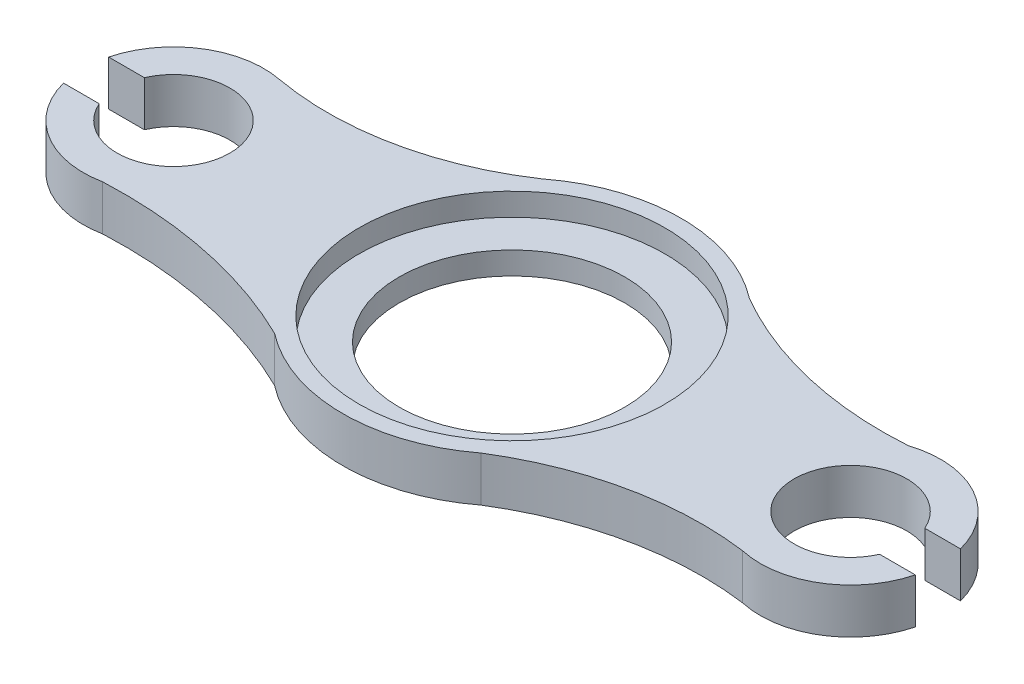
ISO-10303-21;
HEADER;
FILE_DESCRIPTION(('STEP AP214'),'2;1');
FILE_NAME('part.step','',(''),(''),'','','');
FILE_SCHEMA(('AUTOMOTIVE_DESIGN { 1 0 10303 214 1 1 1 1 }'));
ENDSEC;
DATA;
#1=APPLICATION_CONTEXT('core data for automotive mechanical design processes');
#2=APPLICATION_PROTOCOL_DEFINITION('international standard','automotive_design',2000,#1);
#3=PRODUCT_CONTEXT('',#1,'mechanical');
#4=PRODUCT('Part','Part','',(#3));
#5=PRODUCT_RELATED_PRODUCT_CATEGORY('part','',(#4));
#6=PRODUCT_DEFINITION_FORMATION('','',#4);
#7=PRODUCT_DEFINITION_CONTEXT('part definition',#1,'design');
#8=PRODUCT_DEFINITION('design','',#6,#7);
#9=PRODUCT_DEFINITION_SHAPE('','',#8);
#10=(LENGTH_UNIT() NAMED_UNIT(*) SI_UNIT(.MILLI.,.METRE.));
#11=(NAMED_UNIT(*) PLANE_ANGLE_UNIT() SI_UNIT($,.RADIAN.));
#12=(NAMED_UNIT(*) SI_UNIT($,.STERADIAN.) SOLID_ANGLE_UNIT());
#13=UNCERTAINTY_MEASURE_WITH_UNIT(LENGTH_MEASURE(1.E-05),#10,'distance_accuracy_value','');
#14=(GEOMETRIC_REPRESENTATION_CONTEXT(3) GLOBAL_UNCERTAINTY_ASSIGNED_CONTEXT((#13)) GLOBAL_UNIT_ASSIGNED_CONTEXT((#10,
#11,#12)) REPRESENTATION_CONTEXT('',''));
#15=CARTESIAN_POINT('',(0.,0.,0.));
#16=DIRECTION('',(0.,0.,1.));
#17=DIRECTION('',(1.,0.,0.));
#18=AXIS2_PLACEMENT_3D('',#15,#16,#17);
#19=CARTESIAN_POINT('',(0.,20.,0.));
#20=DIRECTION('',(0.,1.,0.));
#21=DIRECTION('',(0.,0.,1.));
#22=AXIS2_PLACEMENT_3D('',#19,#20,#21);
#23=PLANE('',#22);
#24=CARTESIAN_POINT('',(0.,20.,0.));
#25=DIRECTION('',(0.,1.,0.));
#26=DIRECTION('',(0.,0.,1.));
#27=AXIS2_PLACEMENT_3D('',#24,#25,#26);
#28=CIRCLE('',#27,67.75);
#29=CARTESIAN_POINT('',(0.,20.,67.75));
#30=VERTEX_POINT('',#29);
#31=EDGE_CURVE('E306',#30,#30,#28,.T.);
#32=ORIENTED_EDGE('',*,*,#31,.F.);
#33=EDGE_LOOP('',(#32));
#34=FACE_BOUND('',#33,.T.);
#35=CARTESIAN_POINT('',(121.910756914697,20.,182.089420540759));
#36=DIRECTION('',(0.,1.,0.));
#37=DIRECTION('',(0.,0.,1.));
#38=AXIS2_PLACEMENT_3D('',#35,#36,#37);
#39=CIRCLE('',#38,144.370857917916);
#40=CARTESIAN_POINT('',(141.123685995529,20.,39.0027056714536));
#41=VERTEX_POINT('',#40);
#42=CARTESIAN_POINT('',(45.6718820439933,20.,59.4901604516206));
#43=VERTEX_POINT('',#42);
#44=EDGE_CURVE('E261',#41,#43,#39,.T.);
#45=ORIENTED_EDGE('',*,*,#44,.F.);
#46=CARTESIAN_POINT('',(150.,20.,0.));
#47=DIRECTION('',(0.,1.,0.));
#48=DIRECTION('',(0.,0.,1.));
#49=AXIS2_PLACEMENT_3D('',#46,#47,#48);
#50=CIRCLE('',#49,40.);
#51=CARTESIAN_POINT('',(188.729833462074,20.,10.));
#52=VERTEX_POINT('',#51);
#53=EDGE_CURVE('E243',#41,#52,#50,.T.);
#54=ORIENTED_EDGE('',*,*,#53,.T.);
#55=DIRECTION('',(1.,0.,0.));
#56=VECTOR('',#55,1.);
#57=CARTESIAN_POINT('',(0.,20.,9.99999999999999));
#58=LINE('',#57,#56);
#59=CARTESIAN_POINT('',(172.912878474779,20.,10.));
#60=VERTEX_POINT('',#59);
#61=EDGE_CURVE('E360',#60,#52,#58,.T.);
#62=ORIENTED_EDGE('',*,*,#61,.F.);
#63=CARTESIAN_POINT('',(150.,20.,0.));
#64=DIRECTION('',(0.,-1.,0.));
#65=DIRECTION('',(0.,0.,-1.));
#66=AXIS2_PLACEMENT_3D('',#63,#64,#65);
#67=CIRCLE('',#66,25.);
#68=CARTESIAN_POINT('',(172.912878474779,20.,-9.99999999999998));
#69=VERTEX_POINT('',#68);
#70=EDGE_CURVE('E354',#60,#69,#67,.T.);
#71=ORIENTED_EDGE('',*,*,#70,.T.);
#72=DIRECTION('',(1.,0.,0.));
#73=VECTOR('',#72,1.);
#74=CARTESIAN_POINT('',(0.,20.,-10.));
#75=LINE('',#74,#73);
#76=CARTESIAN_POINT('',(188.729833462074,20.,-9.99999999999998));
#77=VERTEX_POINT('',#76);
#78=EDGE_CURVE('E357',#69,#77,#75,.T.);
#79=ORIENTED_EDGE('',*,*,#78,.T.);
#80=CARTESIAN_POINT('',(150.,20.,0.));
#81=DIRECTION('',(0.,1.,0.));
#82=DIRECTION('',(0.,0.,1.));
#83=AXIS2_PLACEMENT_3D('',#80,#81,#82);
#84=CIRCLE('',#83,40.);
#85=CARTESIAN_POINT('',(137.683691630427,20.,-38.0566491975527));
#86=VERTEX_POINT('',#85);
#87=EDGE_CURVE('E274',#77,#86,#84,.T.);
#88=ORIENTED_EDGE('',*,*,#87,.T.);
#89=CARTESIAN_POINT('',(126.34717209194,20.,-197.995020701724));
#90=DIRECTION('',(0.,1.,0.));
#91=DIRECTION('',(0.,0.,1.));
#92=AXIS2_PLACEMENT_3D('',#89,#90,#91);
#93=CIRCLE('',#92,160.339637503185);
#94=CARTESIAN_POINT('',(45.9870488390436,20.,-59.2468677575062));
#95=VERTEX_POINT('',#94);
#96=EDGE_CURVE('E268',#95,#86,#93,.T.);
#97=ORIENTED_EDGE('',*,*,#96,.F.);
#98=CARTESIAN_POINT('',(0.,20.,0.));
#99=DIRECTION('',(0.,1.,0.));
#100=DIRECTION('',(0.,0.,1.));
#101=AXIS2_PLACEMENT_3D('',#98,#99,#100);
#102=CIRCLE('',#101,75.);
#103=CARTESIAN_POINT('',(-45.9870488390434,20.,-59.2468677575063));
#104=VERTEX_POINT('',#103);
#105=EDGE_CURVE('E319',#95,#104,#102,.T.);
#106=ORIENTED_EDGE('',*,*,#105,.T.);
#107=CARTESIAN_POINT('',(-118.810735047892,20.,-168.056888799454));
#108=DIRECTION('',(0.,1.,0.));
#109=DIRECTION('',(0.,0.,1.));
#110=AXIS2_PLACEMENT_3D('',#107,#108,#109);
#111=CIRCLE('',#110,130.930935810426);
#112=CARTESIAN_POINT('',(-142.192482618015,20.,-39.2306343605351));
#113=VERTEX_POINT('',#112);
#114=EDGE_CURVE('E284',#104,#113,#111,.F.);
#115=ORIENTED_EDGE('',*,*,#114,.T.);
#116=CARTESIAN_POINT('',(-150.,20.,0.));
#117=DIRECTION('',(0.,1.,0.));
#118=DIRECTION('',(0.,0.,1.));
#119=AXIS2_PLACEMENT_3D('',#116,#117,#118);
#120=CIRCLE('',#119,40.);
#121=CARTESIAN_POINT('',(-188.729833462074,20.,-10.));
#122=VERTEX_POINT('',#121);
#123=EDGE_CURVE('E313',#113,#122,#120,.T.);
#124=ORIENTED_EDGE('',*,*,#123,.T.);
#125=DIRECTION('',(1.,0.,0.));
#126=VECTOR('',#125,1.);
#127=CARTESIAN_POINT('',(0.,20.,-9.99999999999998));
#128=LINE('',#127,#126);
#129=CARTESIAN_POINT('',(-172.912878474779,20.,-10.));
#130=VERTEX_POINT('',#129);
#131=EDGE_CURVE('E334',#122,#130,#128,.T.);
#132=ORIENTED_EDGE('',*,*,#131,.T.);
#133=CARTESIAN_POINT('',(-150.,20.,0.));
#134=DIRECTION('',(0.,-1.,0.));
#135=DIRECTION('',(0.,0.,-1.));
#136=AXIS2_PLACEMENT_3D('',#133,#134,#135);
#137=CIRCLE('',#136,25.);
#138=CARTESIAN_POINT('',(-172.912878474779,20.,9.99999999999999));
#139=VERTEX_POINT('',#138);
#140=EDGE_CURVE('E336',#130,#139,#137,.T.);
#141=ORIENTED_EDGE('',*,*,#140,.T.);
#142=DIRECTION('',(1.,0.,0.));
#143=VECTOR('',#142,1.);
#144=CARTESIAN_POINT('',(0.,20.,10.));
#145=LINE('',#144,#143);
#146=CARTESIAN_POINT('',(-188.729833462074,20.,9.99999999999999));
#147=VERTEX_POINT('',#146);
#148=EDGE_CURVE('E340',#147,#139,#145,.T.);
#149=ORIENTED_EDGE('',*,*,#148,.F.);
#150=CARTESIAN_POINT('',(-150.,20.,0.));
#151=DIRECTION('',(0.,1.,0.));
#152=DIRECTION('',(0.,0.,1.));
#153=AXIS2_PLACEMENT_3D('',#150,#151,#152);
#154=CIRCLE('',#153,40.);
#155=CARTESIAN_POINT('',(-142.192482618014,20.,39.2306343605349));
#156=VERTEX_POINT('',#155);
#157=EDGE_CURVE('E146',#147,#156,#154,.T.);
#158=ORIENTED_EDGE('',*,*,#157,.T.);
#159=CARTESIAN_POINT('',(-133.055354615705,20.,236.521808115654));
#160=DIRECTION('',(0.,1.,0.));
#161=DIRECTION('',(0.,0.,1.));
#162=AXIS2_PLACEMENT_3D('',#159,#160,#161);
#163=CIRCLE('',#162,197.502643905856);
#164=CARTESIAN_POINT('',(-45.9870488390436,20.,59.2468677575061));
#165=VERTEX_POINT('',#164);
#166=EDGE_CURVE('E297',#156,#165,#163,.F.);
#167=ORIENTED_EDGE('',*,*,#166,.T.);
#168=CARTESIAN_POINT('',(0.,20.,0.));
#169=DIRECTION('',(0.,1.,0.));
#170=DIRECTION('',(0.,0.,1.));
#171=AXIS2_PLACEMENT_3D('',#168,#169,#170);
#172=CIRCLE('',#171,75.);
#173=EDGE_CURVE('E292',#165,#43,#172,.T.);
#174=ORIENTED_EDGE('',*,*,#173,.T.);
#175=EDGE_LOOP('',(#45,#54,#62,#71,#79,#88,#97,#106,#115,#124,#132,#141,#149,#158,#167,#174));
#176=FACE_BOUND('',#175,.T.);
#177=ADVANCED_FACE('F121',(#34,#176),#23,.T.);
#178=CARTESIAN_POINT('',(0.,0.,0.));
#179=DIRECTION('',(0.,1.,0.));
#180=DIRECTION('',(0.,0.,1.));
#181=AXIS2_PLACEMENT_3D('',#178,#179,#180);
#182=PLANE('',#181);
#183=CARTESIAN_POINT('',(0.,0.,0.));
#184=DIRECTION('',(0.,-1.,0.));
#185=DIRECTION('',(0.,0.,-1.));
#186=AXIS2_PLACEMENT_3D('',#183,#184,#185);
#187=CIRCLE('',#186,50.);
#188=CARTESIAN_POINT('',(0.,0.,-50.));
#189=VERTEX_POINT('',#188);
#190=EDGE_CURVE('E345',#189,#189,#187,.T.);
#191=ORIENTED_EDGE('',*,*,#190,.F.);
#192=EDGE_LOOP('',(#191));
#193=FACE_BOUND('',#192,.T.);
#194=CARTESIAN_POINT('',(150.,0.,0.));
#195=DIRECTION('',(0.,1.,0.));
#196=DIRECTION('',(0.,0.,1.));
#197=AXIS2_PLACEMENT_3D('',#194,#195,#196);
#198=CIRCLE('',#197,40.);
#199=CARTESIAN_POINT('',(141.123685995529,0.,39.0027056714536));
#200=VERTEX_POINT('',#199);
#201=CARTESIAN_POINT('',(188.729833462074,0.,10.));
#202=VERTEX_POINT('',#201);
#203=EDGE_CURVE('E240',#200,#202,#198,.T.);
#204=ORIENTED_EDGE('',*,*,#203,.F.);
#205=CARTESIAN_POINT('',(121.910756914697,0.,182.089420540759));
#206=DIRECTION('',(0.,1.,0.));
#207=DIRECTION('',(0.,0.,1.));
#208=AXIS2_PLACEMENT_3D('',#205,#206,#207);
#209=CIRCLE('',#208,144.370857917916);
#210=CARTESIAN_POINT('',(45.6718820439933,0.,59.4901604516206));
#211=VERTEX_POINT('',#210);
#212=EDGE_CURVE('E248',#200,#211,#209,.T.);
#213=ORIENTED_EDGE('',*,*,#212,.T.);
#214=CARTESIAN_POINT('',(0.,0.,0.));
#215=DIRECTION('',(0.,1.,0.));
#216=DIRECTION('',(0.,0.,1.));
#217=AXIS2_PLACEMENT_3D('',#214,#215,#216);
#218=CIRCLE('',#217,75.);
#219=CARTESIAN_POINT('',(-45.9870488390436,0.,59.2468677575061));
#220=VERTEX_POINT('',#219);
#221=EDGE_CURVE('E294',#220,#211,#218,.T.);
#222=ORIENTED_EDGE('',*,*,#221,.F.);
#223=CARTESIAN_POINT('',(-133.055354615705,0.,236.521808115654));
#224=DIRECTION('',(0.,1.,0.));
#225=DIRECTION('',(0.,0.,1.));
#226=AXIS2_PLACEMENT_3D('',#223,#224,#225);
#227=CIRCLE('',#226,197.502643905856);
#228=CARTESIAN_POINT('',(-142.192482618014,0.,39.2306343605349));
#229=VERTEX_POINT('',#228);
#230=EDGE_CURVE('E289',#229,#220,#227,.F.);
#231=ORIENTED_EDGE('',*,*,#230,.F.);
#232=CARTESIAN_POINT('',(-150.,0.,0.));
#233=DIRECTION('',(0.,1.,0.));
#234=DIRECTION('',(0.,0.,1.));
#235=AXIS2_PLACEMENT_3D('',#232,#233,#234);
#236=CIRCLE('',#235,40.);
#237=CARTESIAN_POINT('',(-188.729833462074,0.,9.99999999999999));
#238=VERTEX_POINT('',#237);
#239=EDGE_CURVE('E291',#238,#229,#236,.T.);
#240=ORIENTED_EDGE('',*,*,#239,.F.);
#241=DIRECTION('',(1.,0.,0.));
#242=VECTOR('',#241,1.);
#243=CARTESIAN_POINT('',(0.,0.,10.));
#244=LINE('',#243,#242);
#245=CARTESIAN_POINT('',(-172.912878474779,0.,9.99999999999999));
#246=VERTEX_POINT('',#245);
#247=EDGE_CURVE('E337',#238,#246,#244,.T.);
#248=ORIENTED_EDGE('',*,*,#247,.T.);
#249=CARTESIAN_POINT('',(-150.,0.,0.));
#250=DIRECTION('',(0.,-1.,0.));
#251=DIRECTION('',(0.,0.,-1.));
#252=AXIS2_PLACEMENT_3D('',#249,#250,#251);
#253=CIRCLE('',#252,25.);
#254=CARTESIAN_POINT('',(-172.912878474779,0.,-10.));
#255=VERTEX_POINT('',#254);
#256=EDGE_CURVE('E344',#255,#246,#253,.T.);
#257=ORIENTED_EDGE('',*,*,#256,.F.);
#258=DIRECTION('',(1.,0.,0.));
#259=VECTOR('',#258,1.);
#260=CARTESIAN_POINT('',(0.,0.,-9.99999999999998));
#261=LINE('',#260,#259);
#262=CARTESIAN_POINT('',(-188.729833462074,0.,-10.));
#263=VERTEX_POINT('',#262);
#264=EDGE_CURVE('E342',#263,#255,#261,.T.);
#265=ORIENTED_EDGE('',*,*,#264,.F.);
#266=CARTESIAN_POINT('',(-150.,0.,0.));
#267=DIRECTION('',(0.,1.,0.));
#268=DIRECTION('',(0.,0.,1.));
#269=AXIS2_PLACEMENT_3D('',#266,#267,#268);
#270=CIRCLE('',#269,40.);
#271=CARTESIAN_POINT('',(-142.192482618015,0.,-39.2306343605351));
#272=VERTEX_POINT('',#271);
#273=EDGE_CURVE('E138',#272,#263,#270,.T.);
#274=ORIENTED_EDGE('',*,*,#273,.F.);
#275=CARTESIAN_POINT('',(-118.810735047892,0.,-168.056888799454));
#276=DIRECTION('',(0.,1.,0.));
#277=DIRECTION('',(0.,0.,1.));
#278=AXIS2_PLACEMENT_3D('',#275,#276,#277);
#279=CIRCLE('',#278,130.930935810426);
#280=CARTESIAN_POINT('',(-45.9870488390434,0.,-59.2468677575063));
#281=VERTEX_POINT('',#280);
#282=EDGE_CURVE('E310',#281,#272,#279,.F.);
#283=ORIENTED_EDGE('',*,*,#282,.F.);
#284=CARTESIAN_POINT('',(0.,0.,0.));
#285=DIRECTION('',(0.,1.,0.));
#286=DIRECTION('',(0.,0.,1.));
#287=AXIS2_PLACEMENT_3D('',#284,#285,#286);
#288=CIRCLE('',#287,75.);
#289=CARTESIAN_POINT('',(45.9870488390436,0.,-59.2468677575062));
#290=VERTEX_POINT('',#289);
#291=EDGE_CURVE('E312',#290,#281,#288,.T.);
#292=ORIENTED_EDGE('',*,*,#291,.F.);
#293=CARTESIAN_POINT('',(126.34717209194,0.,-197.995020701724));
#294=DIRECTION('',(0.,1.,0.));
#295=DIRECTION('',(0.,0.,1.));
#296=AXIS2_PLACEMENT_3D('',#293,#294,#295);
#297=CIRCLE('',#296,160.339637503185);
#298=CARTESIAN_POINT('',(137.683691630427,0.,-38.0566491975527));
#299=VERTEX_POINT('',#298);
#300=EDGE_CURVE('E270',#290,#299,#297,.T.);
#301=ORIENTED_EDGE('',*,*,#300,.T.);
#302=CARTESIAN_POINT('',(150.,0.,0.));
#303=DIRECTION('',(0.,1.,0.));
#304=DIRECTION('',(0.,0.,1.));
#305=AXIS2_PLACEMENT_3D('',#302,#303,#304);
#306=CIRCLE('',#305,40.);
#307=CARTESIAN_POINT('',(188.729833462074,0.,-9.99999999999998));
#308=VERTEX_POINT('',#307);
#309=EDGE_CURVE('E273',#308,#299,#306,.T.);
#310=ORIENTED_EDGE('',*,*,#309,.F.);
#311=DIRECTION('',(1.,0.,0.));
#312=VECTOR('',#311,1.);
#313=CARTESIAN_POINT('',(0.,0.,-10.));
#314=LINE('',#313,#312);
#315=CARTESIAN_POINT('',(172.912878474779,0.,-9.99999999999998));
#316=VERTEX_POINT('',#315);
#317=EDGE_CURVE('E366',#316,#308,#314,.T.);
#318=ORIENTED_EDGE('',*,*,#317,.F.);
#319=CARTESIAN_POINT('',(150.,0.,0.));
#320=DIRECTION('',(0.,-1.,0.));
#321=DIRECTION('',(0.,0.,-1.));
#322=AXIS2_PLACEMENT_3D('',#319,#320,#321);
#323=CIRCLE('',#322,25.);
#324=CARTESIAN_POINT('',(172.912878474779,0.,10.));
#325=VERTEX_POINT('',#324);
#326=EDGE_CURVE('E364',#325,#316,#323,.T.);
#327=ORIENTED_EDGE('',*,*,#326,.F.);
#328=DIRECTION('',(1.,0.,0.));
#329=VECTOR('',#328,1.);
#330=CARTESIAN_POINT('',(0.,0.,9.99999999999999));
#331=LINE('',#330,#329);
#332=EDGE_CURVE('E260',#325,#202,#331,.T.);
#333=ORIENTED_EDGE('',*,*,#332,.T.);
#334=EDGE_LOOP('',(#204,#213,#222,#231,#240,#248,#257,#265,#274,#283,#292,#301,#310,#318,#327,#333));
#335=FACE_BOUND('',#334,.T.);
#336=ADVANCED_FACE('F123',(#193,#335),#182,.F.);
#337=CARTESIAN_POINT('',(0.,20.,9.99999999999999));
#338=DIRECTION('',(0.,0.,-1.));
#339=DIRECTION('',(-1.,0.,0.));
#340=AXIS2_PLACEMENT_3D('',#337,#338,#339);
#341=PLANE('',#340);
#342=ORIENTED_EDGE('',*,*,#61,.T.);
#343=DIRECTION('',(0.,1.,0.));
#344=VECTOR('',#343,1.);
#345=CARTESIAN_POINT('',(188.729833462074,0.,10.));
#346=LINE('',#345,#344);
#347=EDGE_CURVE('E266',#202,#52,#346,.T.);
#348=ORIENTED_EDGE('',*,*,#347,.F.);
#349=ORIENTED_EDGE('',*,*,#332,.F.);
#350=DIRECTION('',(0.,-1.,0.));
#351=VECTOR('',#350,1.);
#352=CARTESIAN_POINT('',(172.912878474779,20.,10.));
#353=LINE('',#352,#351);
#354=EDGE_CURVE('E353',#60,#325,#353,.T.);
#355=ORIENTED_EDGE('',*,*,#354,.F.);
#356=EDGE_LOOP('',(#342,#348,#349,#355));
#357=FACE_BOUND('',#356,.T.);
#358=ADVANCED_FACE('F390',(#357),#341,.T.);
#359=CARTESIAN_POINT('',(0.,20.,-10.));
#360=DIRECTION('',(0.,0.,-1.));
#361=DIRECTION('',(-1.,0.,0.));
#362=AXIS2_PLACEMENT_3D('',#359,#360,#361);
#363=PLANE('',#362);
#364=DIRECTION('',(0.,1.,0.));
#365=VECTOR('',#364,1.);
#366=CARTESIAN_POINT('',(188.729833462074,0.,-9.99999999999998));
#367=LINE('',#366,#365);
#368=EDGE_CURVE('E281',#308,#77,#367,.T.);
#369=ORIENTED_EDGE('',*,*,#368,.T.);
#370=ORIENTED_EDGE('',*,*,#78,.F.);
#371=DIRECTION('',(0.,-1.,0.));
#372=VECTOR('',#371,1.);
#373=CARTESIAN_POINT('',(172.912878474779,20.,-9.99999999999998));
#374=LINE('',#373,#372);
#375=EDGE_CURVE('E363',#69,#316,#374,.T.);
#376=ORIENTED_EDGE('',*,*,#375,.T.);
#377=ORIENTED_EDGE('',*,*,#317,.T.);
#378=EDGE_LOOP('',(#369,#370,#376,#377));
#379=FACE_BOUND('',#378,.T.);
#380=ADVANCED_FACE('F374',(#379),#363,.F.);
#381=CARTESIAN_POINT('',(0.,20.,-9.99999999999998));
#382=DIRECTION('',(0.,0.,-1.));
#383=DIRECTION('',(-1.,0.,0.));
#384=AXIS2_PLACEMENT_3D('',#381,#382,#383);
#385=PLANE('',#384);
#386=DIRECTION('',(0.,1.,0.));
#387=VECTOR('',#386,1.);
#388=CARTESIAN_POINT('',(-188.729833462074,0.,-10.));
#389=LINE('',#388,#387);
#390=EDGE_CURVE('E326',#263,#122,#389,.T.);
#391=ORIENTED_EDGE('',*,*,#390,.F.);
#392=ORIENTED_EDGE('',*,*,#264,.T.);
#393=DIRECTION('',(0.,-1.,0.));
#394=VECTOR('',#393,1.);
#395=CARTESIAN_POINT('',(-172.912878474779,20.,-10.));
#396=LINE('',#395,#394);
#397=EDGE_CURVE('E130',#130,#255,#396,.T.);
#398=ORIENTED_EDGE('',*,*,#397,.F.);
#399=ORIENTED_EDGE('',*,*,#131,.F.);
#400=EDGE_LOOP('',(#391,#392,#398,#399));
#401=FACE_BOUND('',#400,.T.);
#402=ADVANCED_FACE('F415',(#401),#385,.F.);
#403=CARTESIAN_POINT('',(0.,20.,10.));
#404=DIRECTION('',(0.,0.,-1.));
#405=DIRECTION('',(-1.,0.,0.));
#406=AXIS2_PLACEMENT_3D('',#403,#404,#405);
#407=PLANE('',#406);
#408=ORIENTED_EDGE('',*,*,#247,.F.);
#409=DIRECTION('',(0.,1.,0.));
#410=VECTOR('',#409,1.);
#411=CARTESIAN_POINT('',(-188.729833462074,0.,9.99999999999999));
#412=LINE('',#411,#410);
#413=EDGE_CURVE('E307',#238,#147,#412,.T.);
#414=ORIENTED_EDGE('',*,*,#413,.T.);
#415=ORIENTED_EDGE('',*,*,#148,.T.);
#416=DIRECTION('',(0.,-1.,0.));
#417=VECTOR('',#416,1.);
#418=CARTESIAN_POINT('',(-172.912878474779,20.,9.99999999999999));
#419=LINE('',#418,#417);
#420=EDGE_CURVE('E12',#139,#246,#419,.T.);
#421=ORIENTED_EDGE('',*,*,#420,.T.);
#422=EDGE_LOOP('',(#408,#414,#415,#421));
#423=FACE_BOUND('',#422,.T.);
#424=ADVANCED_FACE('F404',(#423),#407,.T.);
#425=CARTESIAN_POINT('',(0.,20.,0.));
#426=DIRECTION('',(0.,-1.,0.));
#427=DIRECTION('',(0.,0.,-1.));
#428=AXIS2_PLACEMENT_3D('',#425,#426,#427);
#429=CYLINDRICAL_SURFACE('',#428,50.);
#430=ORIENTED_EDGE('',*,*,#190,.T.);
#431=EDGE_LOOP('',(#430));
#432=FACE_BOUND('',#431,.T.);
#433=CARTESIAN_POINT('',(0.,10.,0.));
#434=DIRECTION('',(0.,1.,0.));
#435=DIRECTION('',(0.,0.,1.));
#436=AXIS2_PLACEMENT_3D('',#433,#434,#435);
#437=CIRCLE('',#436,50.);
#438=CARTESIAN_POINT('',(0.,10.,50.));
#439=VERTEX_POINT('',#438);
#440=EDGE_CURVE('E125',#439,#439,#437,.F.);
#441=ORIENTED_EDGE('',*,*,#440,.F.);
#442=EDGE_LOOP('',(#441));
#443=FACE_BOUND('',#442,.T.);
#444=ADVANCED_FACE('F442',(#432,#443),#429,.F.);
#445=CARTESIAN_POINT('',(150.,20.,0.));
#446=DIRECTION('',(0.,-1.,0.));
#447=DIRECTION('',(0.,0.,-1.));
#448=AXIS2_PLACEMENT_3D('',#445,#446,#447);
#449=CYLINDRICAL_SURFACE('',#448,25.);
#450=ORIENTED_EDGE('',*,*,#326,.T.);
#451=ORIENTED_EDGE('',*,*,#375,.F.);
#452=ORIENTED_EDGE('',*,*,#70,.F.);
#453=ORIENTED_EDGE('',*,*,#354,.T.);
#454=EDGE_LOOP('',(#450,#451,#452,#453));
#455=FACE_BOUND('',#454,.T.);
#456=ADVANCED_FACE('F388',(#455),#449,.F.);
#457=CARTESIAN_POINT('',(-150.,20.,0.));
#458=DIRECTION('',(0.,-1.,0.));
#459=DIRECTION('',(0.,0.,-1.));
#460=AXIS2_PLACEMENT_3D('',#457,#458,#459);
#461=CYLINDRICAL_SURFACE('',#460,25.);
#462=ORIENTED_EDGE('',*,*,#256,.T.);
#463=ORIENTED_EDGE('',*,*,#420,.F.);
#464=ORIENTED_EDGE('',*,*,#140,.F.);
#465=ORIENTED_EDGE('',*,*,#397,.T.);
#466=EDGE_LOOP('',(#462,#463,#464,#465));
#467=FACE_BOUND('',#466,.T.);
#468=ADVANCED_FACE('F410',(#467),#461,.F.);
#469=CARTESIAN_POINT('',(0.,10.,0.));
#470=DIRECTION('',(0.,1.,0.));
#471=DIRECTION('',(0.,0.,1.));
#472=AXIS2_PLACEMENT_3D('',#469,#470,#471);
#473=PLANE('',#472);
#474=CARTESIAN_POINT('',(0.,10.,0.));
#475=DIRECTION('',(0.,1.,0.));
#476=DIRECTION('',(0.,0.,1.));
#477=AXIS2_PLACEMENT_3D('',#474,#475,#476);
#478=CIRCLE('',#477,67.75);
#479=CARTESIAN_POINT('',(0.,10.,67.75));
#480=VERTEX_POINT('',#479);
#481=EDGE_CURVE('E329',#480,#480,#478,.T.);
#482=ORIENTED_EDGE('',*,*,#481,.T.);
#483=EDGE_LOOP('',(#482));
#484=FACE_BOUND('',#483,.T.);
#485=ORIENTED_EDGE('',*,*,#440,.T.);
#486=EDGE_LOOP('',(#485));
#487=FACE_BOUND('',#486,.T.);
#488=ADVANCED_FACE('F454',(#484,#487),#473,.T.);
#489=CARTESIAN_POINT('',(0.,10.,0.));
#490=DIRECTION('',(0.,1.,0.));
#491=DIRECTION('',(0.,0.,1.));
#492=AXIS2_PLACEMENT_3D('',#489,#490,#491);
#493=CYLINDRICAL_SURFACE('',#492,67.75);
#494=ORIENTED_EDGE('',*,*,#481,.F.);
#495=EDGE_LOOP('',(#494));
#496=FACE_BOUND('',#495,.T.);
#497=ORIENTED_EDGE('',*,*,#31,.T.);
#498=EDGE_LOOP('',(#497));
#499=FACE_BOUND('',#498,.T.);
#500=ADVANCED_FACE('F457',(#496,#499),#493,.F.);
#501=CARTESIAN_POINT('',(-133.055354615705,0.,236.521808115654));
#502=DIRECTION('',(0.,1.,0.));
#503=DIRECTION('',(0.,0.,1.));
#504=AXIS2_PLACEMENT_3D('',#501,#502,#503);
#505=CYLINDRICAL_SURFACE('',#504,197.502643905856);
#506=ORIENTED_EDGE('',*,*,#166,.F.);
#507=DIRECTION('',(0.,1.,0.));
#508=VECTOR('',#507,1.);
#509=CARTESIAN_POINT('',(-142.192482618014,0.,39.2306343605349));
#510=LINE('',#509,#508);
#511=EDGE_CURVE('E296',#229,#156,#510,.T.);
#512=ORIENTED_EDGE('',*,*,#511,.F.);
#513=ORIENTED_EDGE('',*,*,#230,.T.);
#514=DIRECTION('',(0.,1.,0.));
#515=VECTOR('',#514,1.);
#516=CARTESIAN_POINT('',(-45.9870488390436,0.,59.2468677575061));
#517=LINE('',#516,#515);
#518=EDGE_CURVE('E303',#220,#165,#517,.T.);
#519=ORIENTED_EDGE('',*,*,#518,.T.);
#520=EDGE_LOOP('',(#506,#512,#513,#519));
#521=FACE_BOUND('',#520,.T.);
#522=ADVANCED_FACE('F400',(#521),#505,.F.);
#523=CARTESIAN_POINT('',(0.,0.,0.));
#524=DIRECTION('',(0.,1.,0.));
#525=DIRECTION('',(0.,0.,1.));
#526=AXIS2_PLACEMENT_3D('',#523,#524,#525);
#527=CYLINDRICAL_SURFACE('',#526,75.);
#528=ORIENTED_EDGE('',*,*,#173,.F.);
#529=ORIENTED_EDGE('',*,*,#518,.F.);
#530=ORIENTED_EDGE('',*,*,#221,.T.);
#531=DIRECTION('',(0.,1.,0.));
#532=VECTOR('',#531,1.);
#533=CARTESIAN_POINT('',(45.6718820439933,0.,59.4901604516206));
#534=LINE('',#533,#532);
#535=EDGE_CURVE('E247',#211,#43,#534,.T.);
#536=ORIENTED_EDGE('',*,*,#535,.T.);
#537=EDGE_LOOP('',(#528,#529,#530,#536));
#538=FACE_BOUND('',#537,.T.);
#539=ADVANCED_FACE('F394',(#538),#527,.T.);
#540=CARTESIAN_POINT('',(-150.,0.,0.));
#541=DIRECTION('',(0.,1.,0.));
#542=DIRECTION('',(0.,0.,1.));
#543=AXIS2_PLACEMENT_3D('',#540,#541,#542);
#544=CYLINDRICAL_SURFACE('',#543,40.);
#545=ORIENTED_EDGE('',*,*,#157,.F.);
#546=ORIENTED_EDGE('',*,*,#413,.F.);
#547=ORIENTED_EDGE('',*,*,#239,.T.);
#548=ORIENTED_EDGE('',*,*,#511,.T.);
#549=EDGE_LOOP('',(#545,#546,#547,#548));
#550=FACE_BOUND('',#549,.T.);
#551=ADVANCED_FACE('F401',(#550),#544,.T.);
#552=CARTESIAN_POINT('',(-118.810735047892,0.,-168.056888799454));
#553=DIRECTION('',(0.,1.,0.));
#554=DIRECTION('',(0.,0.,1.));
#555=AXIS2_PLACEMENT_3D('',#552,#553,#554);
#556=CYLINDRICAL_SURFACE('',#555,130.930935810426);
#557=ORIENTED_EDGE('',*,*,#114,.F.);
#558=DIRECTION('',(0.,1.,0.));
#559=VECTOR('',#558,1.);
#560=CARTESIAN_POINT('',(-45.9870488390434,0.,-59.2468677575063));
#561=LINE('',#560,#559);
#562=EDGE_CURVE('E316',#281,#104,#561,.T.);
#563=ORIENTED_EDGE('',*,*,#562,.F.);
#564=ORIENTED_EDGE('',*,*,#282,.T.);
#565=DIRECTION('',(0.,1.,0.));
#566=VECTOR('',#565,1.);
#567=CARTESIAN_POINT('',(-142.192482618015,0.,-39.2306343605351));
#568=LINE('',#567,#566);
#569=EDGE_CURVE('E300',#272,#113,#568,.T.);
#570=ORIENTED_EDGE('',*,*,#569,.T.);
#571=EDGE_LOOP('',(#557,#563,#564,#570));
#572=FACE_BOUND('',#571,.T.);
#573=ADVANCED_FACE('F420',(#572),#556,.F.);
#574=CARTESIAN_POINT('',(-150.,0.,0.));
#575=DIRECTION('',(0.,1.,0.));
#576=DIRECTION('',(0.,0.,1.));
#577=AXIS2_PLACEMENT_3D('',#574,#575,#576);
#578=CYLINDRICAL_SURFACE('',#577,40.);
#579=ORIENTED_EDGE('',*,*,#123,.F.);
#580=ORIENTED_EDGE('',*,*,#569,.F.);
#581=ORIENTED_EDGE('',*,*,#273,.T.);
#582=ORIENTED_EDGE('',*,*,#390,.T.);
#583=EDGE_LOOP('',(#579,#580,#581,#582));
#584=FACE_BOUND('',#583,.T.);
#585=ADVANCED_FACE('F416',(#584),#578,.T.);
#586=CARTESIAN_POINT('',(0.,0.,0.));
#587=DIRECTION('',(0.,1.,0.));
#588=DIRECTION('',(0.,0.,1.));
#589=AXIS2_PLACEMENT_3D('',#586,#587,#588);
#590=CYLINDRICAL_SURFACE('',#589,75.);
#591=ORIENTED_EDGE('',*,*,#105,.F.);
#592=DIRECTION('',(0.,1.,0.));
#593=VECTOR('',#592,1.);
#594=CARTESIAN_POINT('',(45.9870488390436,0.,-59.2468677575062));
#595=LINE('',#594,#593);
#596=EDGE_CURVE('E276',#290,#95,#595,.T.);
#597=ORIENTED_EDGE('',*,*,#596,.F.);
#598=ORIENTED_EDGE('',*,*,#291,.T.);
#599=ORIENTED_EDGE('',*,*,#562,.T.);
#600=EDGE_LOOP('',(#591,#597,#598,#599));
#601=FACE_BOUND('',#600,.T.);
#602=ADVANCED_FACE('F422',(#601),#590,.T.);
#603=CARTESIAN_POINT('',(150.,0.,0.));
#604=DIRECTION('',(0.,1.,0.));
#605=DIRECTION('',(0.,0.,1.));
#606=AXIS2_PLACEMENT_3D('',#603,#604,#605);
#607=CYLINDRICAL_SURFACE('',#606,40.);
#608=ORIENTED_EDGE('',*,*,#87,.F.);
#609=ORIENTED_EDGE('',*,*,#368,.F.);
#610=ORIENTED_EDGE('',*,*,#309,.T.);
#611=DIRECTION('',(0.,1.,0.));
#612=VECTOR('',#611,1.);
#613=CARTESIAN_POINT('',(137.683691630427,0.,-38.0566491975527));
#614=LINE('',#613,#612);
#615=EDGE_CURVE('E285',#299,#86,#614,.T.);
#616=ORIENTED_EDGE('',*,*,#615,.T.);
#617=EDGE_LOOP('',(#608,#609,#610,#616));
#618=FACE_BOUND('',#617,.T.);
#619=ADVANCED_FACE('F381',(#618),#607,.T.);
#620=CARTESIAN_POINT('',(126.34717209194,0.,-197.995020701724));
#621=DIRECTION('',(0.,1.,0.));
#622=DIRECTION('',(0.,0.,1.));
#623=AXIS2_PLACEMENT_3D('',#620,#621,#622);
#624=CYLINDRICAL_SURFACE('',#623,160.339637503185);
#625=ORIENTED_EDGE('',*,*,#96,.T.);
#626=ORIENTED_EDGE('',*,*,#615,.F.);
#627=ORIENTED_EDGE('',*,*,#300,.F.);
#628=ORIENTED_EDGE('',*,*,#596,.T.);
#629=EDGE_LOOP('',(#625,#626,#627,#628));
#630=FACE_BOUND('',#629,.T.);
#631=ADVANCED_FACE('F383',(#630),#624,.F.);
#632=CARTESIAN_POINT('',(150.,0.,0.));
#633=DIRECTION('',(0.,1.,0.));
#634=DIRECTION('',(0.,0.,1.));
#635=AXIS2_PLACEMENT_3D('',#632,#633,#634);
#636=CYLINDRICAL_SURFACE('',#635,40.);
#637=ORIENTED_EDGE('',*,*,#53,.F.);
#638=DIRECTION('',(0.,1.,0.));
#639=VECTOR('',#638,1.);
#640=CARTESIAN_POINT('',(141.123685995529,0.,39.0027056714536));
#641=LINE('',#640,#639);
#642=EDGE_CURVE('E236',#200,#41,#641,.T.);
#643=ORIENTED_EDGE('',*,*,#642,.F.);
#644=ORIENTED_EDGE('',*,*,#203,.T.);
#645=ORIENTED_EDGE('',*,*,#347,.T.);
#646=EDGE_LOOP('',(#637,#643,#644,#645));
#647=FACE_BOUND('',#646,.T.);
#648=ADVANCED_FACE('F238',(#647),#636,.T.);
#649=CARTESIAN_POINT('',(121.910756914697,0.,182.089420540759));
#650=DIRECTION('',(0.,1.,0.));
#651=DIRECTION('',(0.,0.,1.));
#652=AXIS2_PLACEMENT_3D('',#649,#650,#651);
#653=CYLINDRICAL_SURFACE('',#652,144.370857917916);
#654=ORIENTED_EDGE('',*,*,#44,.T.);
#655=ORIENTED_EDGE('',*,*,#535,.F.);
#656=ORIENTED_EDGE('',*,*,#212,.F.);
#657=ORIENTED_EDGE('',*,*,#642,.T.);
#658=EDGE_LOOP('',(#654,#655,#656,#657));
#659=FACE_BOUND('',#658,.T.);
#660=ADVANCED_FACE('F252',(#659),#653,.F.);
#661=CLOSED_SHELL('',(#177,#336,#358,#380,#402,#424,#444,#456,#468,#488,#500,#522,#539,#551,
#573,#585,#602,#619,#631,#648,#660));
#662=MANIFOLD_SOLID_BREP('B2',#661);
#663=ADVANCED_BREP_SHAPE_REPRESENTATION('',(#18,#662),#14);
#664=SHAPE_DEFINITION_REPRESENTATION(#9,#663);
ENDSEC;
END-ISO-10303-21;
